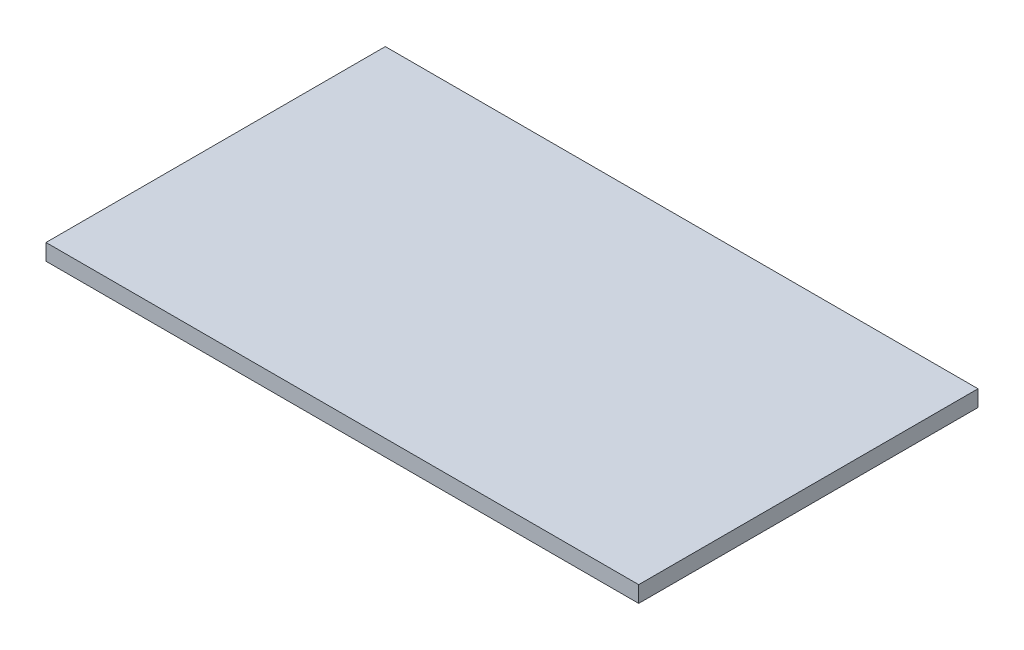
ISO-10303-21;
HEADER;
FILE_DESCRIPTION(('STEP AP214'),'2;1');
FILE_NAME('part.step','',(''),(''),'','','');
FILE_SCHEMA(('AUTOMOTIVE_DESIGN { 1 0 10303 214 1 1 1 1 }'));
ENDSEC;
DATA;
#1=APPLICATION_CONTEXT('core data for automotive mechanical design processes');
#2=APPLICATION_PROTOCOL_DEFINITION('international standard','automotive_design',2000,#1);
#3=PRODUCT_CONTEXT('',#1,'mechanical');
#4=PRODUCT('Part','Part','',(#3));
#5=PRODUCT_RELATED_PRODUCT_CATEGORY('part','',(#4));
#6=PRODUCT_DEFINITION_FORMATION('','',#4);
#7=PRODUCT_DEFINITION_CONTEXT('part definition',#1,'design');
#8=PRODUCT_DEFINITION('design','',#6,#7);
#9=PRODUCT_DEFINITION_SHAPE('','',#8);
#10=(LENGTH_UNIT() NAMED_UNIT(*) SI_UNIT(.MILLI.,.METRE.));
#11=(NAMED_UNIT(*) PLANE_ANGLE_UNIT() SI_UNIT($,.RADIAN.));
#12=(NAMED_UNIT(*) SI_UNIT($,.STERADIAN.) SOLID_ANGLE_UNIT());
#13=UNCERTAINTY_MEASURE_WITH_UNIT(LENGTH_MEASURE(1.E-05),#10,'distance_accuracy_value','');
#14=(GEOMETRIC_REPRESENTATION_CONTEXT(3) GLOBAL_UNCERTAINTY_ASSIGNED_CONTEXT((#13)) GLOBAL_UNIT_ASSIGNED_CONTEXT((#10,
#11,#12)) REPRESENTATION_CONTEXT('',''));
#15=CARTESIAN_POINT('',(0.,0.,0.));
#16=DIRECTION('',(0.,0.,1.));
#17=DIRECTION('',(1.,0.,0.));
#18=AXIS2_PLACEMENT_3D('',#15,#16,#17);
#19=CARTESIAN_POINT('',(0.,0.,0.));
#20=DIRECTION('',(0.,1.,0.));
#21=DIRECTION('',(0.,0.,1.));
#22=AXIS2_PLACEMENT_3D('',#19,#20,#21);
#23=PLANE('',#22);
#24=DIRECTION('',(-1.,0.,0.));
#25=VECTOR('',#24,1.);
#26=CARTESIAN_POINT('',(54.619,0.,-31.27));
#27=LINE('',#26,#25);
#28=CARTESIAN_POINT('',(54.619,0.,-31.27));
#29=VERTEX_POINT('',#28);
#30=CARTESIAN_POINT('',(-54.619,0.,-31.27));
#31=VERTEX_POINT('',#30);
#32=EDGE_CURVE('E198',#29,#31,#27,.T.);
#33=ORIENTED_EDGE('',*,*,#32,.F.);
#34=DIRECTION('',(0.,0.,-1.));
#35=VECTOR('',#34,1.);
#36=CARTESIAN_POINT('',(54.619,0.,31.27));
#37=LINE('',#36,#35);
#38=CARTESIAN_POINT('',(54.619,0.,31.27));
#39=VERTEX_POINT('',#38);
#40=EDGE_CURVE('E204',#39,#29,#37,.T.);
#41=ORIENTED_EDGE('',*,*,#40,.F.);
#42=DIRECTION('',(1.,0.,0.));
#43=VECTOR('',#42,1.);
#44=CARTESIAN_POINT('',(-54.619,0.,31.27));
#45=LINE('',#44,#43);
#46=CARTESIAN_POINT('',(-54.619,0.,31.27));
#47=VERTEX_POINT('',#46);
#48=EDGE_CURVE('E220',#47,#39,#45,.T.);
#49=ORIENTED_EDGE('',*,*,#48,.F.);
#50=DIRECTION('',(0.,0.,1.));
#51=VECTOR('',#50,1.);
#52=CARTESIAN_POINT('',(-54.619,0.,-31.27));
#53=LINE('',#52,#51);
#54=EDGE_CURVE('E217',#31,#47,#53,.T.);
#55=ORIENTED_EDGE('',*,*,#54,.F.);
#56=EDGE_LOOP('',(#33,#41,#49,#55));
#57=FACE_BOUND('',#56,.T.);
#58=DIRECTION('',(0.,0.,1.));
#59=VECTOR('',#58,1.);
#60=CARTESIAN_POINT('',(53.619,0.,-30.27));
#61=LINE('',#60,#59);
#62=CARTESIAN_POINT('',(53.619,0.,-30.27));
#63=VERTEX_POINT('',#62);
#64=CARTESIAN_POINT('',(53.619,0.,30.27));
#65=VERTEX_POINT('',#64);
#66=EDGE_CURVE('E129',#63,#65,#61,.T.);
#67=ORIENTED_EDGE('',*,*,#66,.F.);
#68=DIRECTION('',(1.,0.,0.));
#69=VECTOR('',#68,1.);
#70=CARTESIAN_POINT('',(-53.619,0.,-30.27));
#71=LINE('',#70,#69);
#72=CARTESIAN_POINT('',(-53.619,0.,-30.27));
#73=VERTEX_POINT('',#72);
#74=EDGE_CURVE('E161',#73,#63,#71,.T.);
#75=ORIENTED_EDGE('',*,*,#74,.F.);
#76=DIRECTION('',(0.,0.,-1.));
#77=VECTOR('',#76,1.);
#78=CARTESIAN_POINT('',(-53.619,0.,30.27));
#79=LINE('',#78,#77);
#80=CARTESIAN_POINT('',(-53.619,0.,30.27));
#81=VERTEX_POINT('',#80);
#82=EDGE_CURVE('E60',#81,#73,#79,.T.);
#83=ORIENTED_EDGE('',*,*,#82,.F.);
#84=DIRECTION('',(-1.,0.,0.));
#85=VECTOR('',#84,1.);
#86=CARTESIAN_POINT('',(53.619,0.,30.27));
#87=LINE('',#86,#85);
#88=EDGE_CURVE('E55',#65,#81,#87,.T.);
#89=ORIENTED_EDGE('',*,*,#88,.F.);
#90=EDGE_LOOP('',(#67,#75,#83,#89));
#91=FACE_BOUND('',#90,.T.);
#92=ADVANCED_FACE('F39',(#57,#91),#23,.F.);
#93=CARTESIAN_POINT('',(54.619,3.,-31.27));
#94=DIRECTION('',(0.,0.,1.));
#95=DIRECTION('',(1.,0.,0.));
#96=AXIS2_PLACEMENT_3D('',#93,#94,#95);
#97=PLANE('',#96);
#98=ORIENTED_EDGE('',*,*,#32,.T.);
#99=DIRECTION('',(0.,-1.,0.));
#100=VECTOR('',#99,1.);
#101=CARTESIAN_POINT('',(-54.619,3.,-31.27));
#102=LINE('',#101,#100);
#103=CARTESIAN_POINT('',(-54.619,3.,-31.27));
#104=VERTEX_POINT('',#103);
#105=EDGE_CURVE('E11',#104,#31,#102,.T.);
#106=ORIENTED_EDGE('',*,*,#105,.F.);
#107=DIRECTION('',(-1.,0.,0.));
#108=VECTOR('',#107,1.);
#109=CARTESIAN_POINT('',(54.619,3.,-31.27));
#110=LINE('',#109,#108);
#111=CARTESIAN_POINT('',(54.619,3.,-31.27));
#112=VERTEX_POINT('',#111);
#113=EDGE_CURVE('E199',#112,#104,#110,.T.);
#114=ORIENTED_EDGE('',*,*,#113,.F.);
#115=DIRECTION('',(0.,-1.,0.));
#116=VECTOR('',#115,1.);
#117=CARTESIAN_POINT('',(54.619,3.,-31.27));
#118=LINE('',#117,#116);
#119=EDGE_CURVE('E213',#112,#29,#118,.T.);
#120=ORIENTED_EDGE('',*,*,#119,.T.);
#121=EDGE_LOOP('',(#98,#106,#114,#120));
#122=FACE_BOUND('',#121,.T.);
#123=ADVANCED_FACE('F41',(#122),#97,.F.);
#124=CARTESIAN_POINT('',(-54.619,3.,-31.27));
#125=DIRECTION('',(1.,0.,0.));
#126=DIRECTION('',(0.,0.,-1.));
#127=AXIS2_PLACEMENT_3D('',#124,#125,#126);
#128=PLANE('',#127);
#129=ORIENTED_EDGE('',*,*,#54,.T.);
#130=DIRECTION('',(0.,-1.,0.));
#131=VECTOR('',#130,1.);
#132=CARTESIAN_POINT('',(-54.619,3.,31.27));
#133=LINE('',#132,#131);
#134=CARTESIAN_POINT('',(-54.619,3.,31.27));
#135=VERTEX_POINT('',#134);
#136=EDGE_CURVE('E48',#135,#47,#133,.T.);
#137=ORIENTED_EDGE('',*,*,#136,.F.);
#138=DIRECTION('',(0.,0.,1.));
#139=VECTOR('',#138,1.);
#140=CARTESIAN_POINT('',(-54.619,3.,-31.27));
#141=LINE('',#140,#139);
#142=EDGE_CURVE('E203',#104,#135,#141,.T.);
#143=ORIENTED_EDGE('',*,*,#142,.F.);
#144=ORIENTED_EDGE('',*,*,#105,.T.);
#145=EDGE_LOOP('',(#129,#137,#143,#144));
#146=FACE_BOUND('',#145,.T.);
#147=ADVANCED_FACE('F252',(#146),#128,.F.);
#148=CARTESIAN_POINT('',(-54.619,3.,31.27));
#149=DIRECTION('',(0.,0.,-1.));
#150=DIRECTION('',(-1.,0.,0.));
#151=AXIS2_PLACEMENT_3D('',#148,#149,#150);
#152=PLANE('',#151);
#153=ORIENTED_EDGE('',*,*,#48,.T.);
#154=DIRECTION('',(0.,-1.,0.));
#155=VECTOR('',#154,1.);
#156=CARTESIAN_POINT('',(54.619,3.,31.27));
#157=LINE('',#156,#155);
#158=CARTESIAN_POINT('',(54.619,3.,31.27));
#159=VERTEX_POINT('',#158);
#160=EDGE_CURVE('E228',#159,#39,#157,.T.);
#161=ORIENTED_EDGE('',*,*,#160,.F.);
#162=DIRECTION('',(1.,0.,0.));
#163=VECTOR('',#162,1.);
#164=CARTESIAN_POINT('',(-54.619,3.,31.27));
#165=LINE('',#164,#163);
#166=EDGE_CURVE('E207',#135,#159,#165,.T.);
#167=ORIENTED_EDGE('',*,*,#166,.F.);
#168=ORIENTED_EDGE('',*,*,#136,.T.);
#169=EDGE_LOOP('',(#153,#161,#167,#168));
#170=FACE_BOUND('',#169,.T.);
#171=ADVANCED_FACE('F237',(#170),#152,.F.);
#172=CARTESIAN_POINT('',(54.619,3.,31.27));
#173=DIRECTION('',(-1.,0.,0.));
#174=DIRECTION('',(0.,0.,1.));
#175=AXIS2_PLACEMENT_3D('',#172,#173,#174);
#176=PLANE('',#175);
#177=ORIENTED_EDGE('',*,*,#40,.T.);
#178=ORIENTED_EDGE('',*,*,#119,.F.);
#179=DIRECTION('',(0.,0.,-1.));
#180=VECTOR('',#179,1.);
#181=CARTESIAN_POINT('',(54.619,3.,31.27));
#182=LINE('',#181,#180);
#183=EDGE_CURVE('E210',#159,#112,#182,.T.);
#184=ORIENTED_EDGE('',*,*,#183,.F.);
#185=ORIENTED_EDGE('',*,*,#160,.T.);
#186=EDGE_LOOP('',(#177,#178,#184,#185));
#187=FACE_BOUND('',#186,.T.);
#188=ADVANCED_FACE('F245',(#187),#176,.F.);
#189=CARTESIAN_POINT('',(0.,3.,0.));
#190=DIRECTION('',(0.,1.,0.));
#191=DIRECTION('',(0.,0.,1.));
#192=AXIS2_PLACEMENT_3D('',#189,#190,#191);
#193=PLANE('',#192);
#194=ORIENTED_EDGE('',*,*,#113,.T.);
#195=ORIENTED_EDGE('',*,*,#142,.T.);
#196=ORIENTED_EDGE('',*,*,#166,.T.);
#197=ORIENTED_EDGE('',*,*,#183,.T.);
#198=EDGE_LOOP('',(#194,#195,#196,#197));
#199=FACE_BOUND('',#198,.T.);
#200=ADVANCED_FACE('F251',(#199),#193,.T.);
#201=CARTESIAN_POINT('',(53.619,0.,-30.27));
#202=DIRECTION('',(0.707106781186546,-0.707106781186549,0.));
#203=DIRECTION('',(0.707106781186549,0.707106781186546,0.));
#204=AXIS2_PLACEMENT_3D('',#201,#202,#203);
#205=PLANE('',#204);
#206=DIRECTION('',(0.,0.,-1.));
#207=VECTOR('',#206,1.);
#208=CARTESIAN_POINT('',(53.119,-0.499999999999999,-30.27));
#209=LINE('',#208,#207);
#210=CARTESIAN_POINT('',(53.119,-0.499999999999999,-29.77));
#211=VERTEX_POINT('',#210);
#212=CARTESIAN_POINT('',(53.119,-0.499999999999999,29.77));
#213=VERTEX_POINT('',#212);
#214=EDGE_CURVE('E124',#211,#213,#209,.F.);
#215=ORIENTED_EDGE('',*,*,#214,.F.);
#216=DIRECTION('',(0.577350269189627,0.577350269189624,-0.577350269189627));
#217=VECTOR('',#216,1.);
#218=CARTESIAN_POINT('',(53.619,0.,-30.27));
#219=LINE('',#218,#217);
#220=EDGE_CURVE('E165',#211,#63,#219,.T.);
#221=ORIENTED_EDGE('',*,*,#220,.T.);
#222=ORIENTED_EDGE('',*,*,#66,.T.);
#223=DIRECTION('',(0.577350269189627,0.577350269189624,0.577350269189627));
#224=VECTOR('',#223,1.);
#225=CARTESIAN_POINT('',(53.619,0.,30.27));
#226=LINE('',#225,#224);
#227=EDGE_CURVE('E166',#213,#65,#226,.T.);
#228=ORIENTED_EDGE('',*,*,#227,.F.);
#229=EDGE_LOOP('',(#215,#221,#222,#228));
#230=FACE_BOUND('',#229,.T.);
#231=ADVANCED_FACE('F281',(#230),#205,.T.);
#232=CARTESIAN_POINT('',(53.619,0.,30.27));
#233=DIRECTION('',(0.,-0.707106781186549,0.707106781186546));
#234=DIRECTION('',(0.,-0.707106781186546,-0.707106781186549));
#235=AXIS2_PLACEMENT_3D('',#232,#233,#234);
#236=PLANE('',#235);
#237=DIRECTION('',(1.,0.,0.));
#238=VECTOR('',#237,1.);
#239=CARTESIAN_POINT('',(53.619,-0.499999999999999,29.77));
#240=LINE('',#239,#238);
#241=CARTESIAN_POINT('',(-53.119,-0.499999999999999,29.77));
#242=VERTEX_POINT('',#241);
#243=EDGE_CURVE('E188',#213,#242,#240,.F.);
#244=ORIENTED_EDGE('',*,*,#243,.F.);
#245=ORIENTED_EDGE('',*,*,#227,.T.);
#246=ORIENTED_EDGE('',*,*,#88,.T.);
#247=DIRECTION('',(-0.577350269189627,0.577350269189624,0.577350269189627));
#248=VECTOR('',#247,1.);
#249=CARTESIAN_POINT('',(-53.619,0.,30.27));
#250=LINE('',#249,#248);
#251=EDGE_CURVE('E169',#242,#81,#250,.T.);
#252=ORIENTED_EDGE('',*,*,#251,.F.);
#253=EDGE_LOOP('',(#244,#245,#246,#252));
#254=FACE_BOUND('',#253,.T.);
#255=ADVANCED_FACE('F286',(#254),#236,.T.);
#256=CARTESIAN_POINT('',(-53.619,0.,30.27));
#257=DIRECTION('',(-0.707106781186546,-0.707106781186549,0.));
#258=DIRECTION('',(0.707106781186549,-0.707106781186546,0.));
#259=AXIS2_PLACEMENT_3D('',#256,#257,#258);
#260=PLANE('',#259);
#261=DIRECTION('',(0.,0.,1.));
#262=VECTOR('',#261,1.);
#263=CARTESIAN_POINT('',(-53.119,-0.499999999999999,30.27));
#264=LINE('',#263,#262);
#265=CARTESIAN_POINT('',(-53.119,-0.499999999999999,-29.77));
#266=VERTEX_POINT('',#265);
#267=EDGE_CURVE('E191',#242,#266,#264,.F.);
#268=ORIENTED_EDGE('',*,*,#267,.F.);
#269=ORIENTED_EDGE('',*,*,#251,.T.);
#270=ORIENTED_EDGE('',*,*,#82,.T.);
#271=DIRECTION('',(-0.577350269189627,0.577350269189624,-0.577350269189627));
#272=VECTOR('',#271,1.);
#273=CARTESIAN_POINT('',(-53.619,0.,-30.27));
#274=LINE('',#273,#272);
#275=EDGE_CURVE('E173',#266,#73,#274,.T.);
#276=ORIENTED_EDGE('',*,*,#275,.F.);
#277=EDGE_LOOP('',(#268,#269,#270,#276));
#278=FACE_BOUND('',#277,.T.);
#279=ADVANCED_FACE('F334',(#278),#260,.T.);
#280=CARTESIAN_POINT('',(-53.619,0.,-30.27));
#281=DIRECTION('',(0.,-0.707106781186549,-0.707106781186546));
#282=DIRECTION('',(0.,0.707106781186546,-0.707106781186549));
#283=AXIS2_PLACEMENT_3D('',#280,#281,#282);
#284=PLANE('',#283);
#285=DIRECTION('',(-1.,0.,0.));
#286=VECTOR('',#285,1.);
#287=CARTESIAN_POINT('',(-53.619,-0.499999999999999,-29.77));
#288=LINE('',#287,#286);
#289=EDGE_CURVE('E195',#266,#211,#288,.F.);
#290=ORIENTED_EDGE('',*,*,#289,.F.);
#291=ORIENTED_EDGE('',*,*,#275,.T.);
#292=ORIENTED_EDGE('',*,*,#74,.T.);
#293=ORIENTED_EDGE('',*,*,#220,.F.);
#294=EDGE_LOOP('',(#290,#291,#292,#293));
#295=FACE_BOUND('',#294,.T.);
#296=ADVANCED_FACE('F343',(#295),#284,.T.);
#297=CARTESIAN_POINT('',(52.619,0.,-29.27));
#298=DIRECTION('',(-0.707106781186546,-0.707106781186549,0.));
#299=DIRECTION('',(0.707106781186549,-0.707106781186546,0.));
#300=AXIS2_PLACEMENT_3D('',#297,#298,#299);
#301=PLANE('',#300);
#302=DIRECTION('',(-0.577350269189627,0.577350269189624,0.577350269189627));
#303=VECTOR('',#302,1.);
#304=CARTESIAN_POINT('',(52.619,0.,-29.27));
#305=LINE('',#304,#303);
#306=CARTESIAN_POINT('',(52.619,0.,-29.27));
#307=VERTEX_POINT('',#306);
#308=EDGE_CURVE('E153',#211,#307,#305,.T.);
#309=ORIENTED_EDGE('',*,*,#308,.F.);
#310=ORIENTED_EDGE('',*,*,#214,.T.);
#311=DIRECTION('',(-0.577350269189627,0.577350269189624,-0.577350269189627));
#312=VECTOR('',#311,1.);
#313=CARTESIAN_POINT('',(52.619,0.,29.27));
#314=LINE('',#313,#312);
#315=CARTESIAN_POINT('',(52.619,0.,29.27));
#316=VERTEX_POINT('',#315);
#317=EDGE_CURVE('E116',#213,#316,#314,.T.);
#318=ORIENTED_EDGE('',*,*,#317,.T.);
#319=DIRECTION('',(0.,0.,1.));
#320=VECTOR('',#319,1.);
#321=CARTESIAN_POINT('',(52.619,0.,-29.27));
#322=LINE('',#321,#320);
#323=EDGE_CURVE('E121',#307,#316,#322,.T.);
#324=ORIENTED_EDGE('',*,*,#323,.F.);
#325=EDGE_LOOP('',(#309,#310,#318,#324));
#326=FACE_BOUND('',#325,.T.);
#327=ADVANCED_FACE('F119',(#326),#301,.T.);
#328=CARTESIAN_POINT('',(52.619,0.,29.27));
#329=DIRECTION('',(0.,-0.707106781186549,-0.707106781186546));
#330=DIRECTION('',(0.,0.707106781186546,-0.707106781186549));
#331=AXIS2_PLACEMENT_3D('',#328,#329,#330);
#332=PLANE('',#331);
#333=ORIENTED_EDGE('',*,*,#317,.F.);
#334=ORIENTED_EDGE('',*,*,#243,.T.);
#335=DIRECTION('',(0.577350269189627,0.577350269189624,-0.577350269189627));
#336=VECTOR('',#335,1.);
#337=CARTESIAN_POINT('',(-52.619,0.,29.27));
#338=LINE('',#337,#336);
#339=CARTESIAN_POINT('',(-52.619,0.,29.27));
#340=VERTEX_POINT('',#339);
#341=EDGE_CURVE('E130',#242,#340,#338,.T.);
#342=ORIENTED_EDGE('',*,*,#341,.T.);
#343=DIRECTION('',(-1.,0.,0.));
#344=VECTOR('',#343,1.);
#345=CARTESIAN_POINT('',(52.619,0.,29.27));
#346=LINE('',#345,#344);
#347=EDGE_CURVE('E133',#316,#340,#346,.T.);
#348=ORIENTED_EDGE('',*,*,#347,.F.);
#349=EDGE_LOOP('',(#333,#334,#342,#348));
#350=FACE_BOUND('',#349,.T.);
#351=ADVANCED_FACE('F134',(#350),#332,.T.);
#352=CARTESIAN_POINT('',(-52.619,0.,29.27));
#353=DIRECTION('',(0.707106781186546,-0.707106781186549,0.));
#354=DIRECTION('',(0.707106781186549,0.707106781186546,0.));
#355=AXIS2_PLACEMENT_3D('',#352,#353,#354);
#356=PLANE('',#355);
#357=ORIENTED_EDGE('',*,*,#341,.F.);
#358=ORIENTED_EDGE('',*,*,#267,.T.);
#359=DIRECTION('',(0.577350269189627,0.577350269189624,0.577350269189627));
#360=VECTOR('',#359,1.);
#361=CARTESIAN_POINT('',(-52.619,0.,-29.27));
#362=LINE('',#361,#360);
#363=CARTESIAN_POINT('',(-52.619,0.,-29.27));
#364=VERTEX_POINT('',#363);
#365=EDGE_CURVE('E180',#266,#364,#362,.T.);
#366=ORIENTED_EDGE('',*,*,#365,.T.);
#367=DIRECTION('',(0.,0.,-1.));
#368=VECTOR('',#367,1.);
#369=CARTESIAN_POINT('',(-52.619,0.,29.27));
#370=LINE('',#369,#368);
#371=EDGE_CURVE('E140',#340,#364,#370,.T.);
#372=ORIENTED_EDGE('',*,*,#371,.F.);
#373=EDGE_LOOP('',(#357,#358,#366,#372));
#374=FACE_BOUND('',#373,.T.);
#375=ADVANCED_FACE('F270',(#374),#356,.T.);
#376=CARTESIAN_POINT('',(-52.619,0.,-29.27));
#377=DIRECTION('',(0.,-0.707106781186549,0.707106781186546));
#378=DIRECTION('',(0.,-0.707106781186546,-0.707106781186549));
#379=AXIS2_PLACEMENT_3D('',#376,#377,#378);
#380=PLANE('',#379);
#381=ORIENTED_EDGE('',*,*,#365,.F.);
#382=ORIENTED_EDGE('',*,*,#289,.T.);
#383=ORIENTED_EDGE('',*,*,#308,.T.);
#384=DIRECTION('',(1.,0.,0.));
#385=VECTOR('',#384,1.);
#386=CARTESIAN_POINT('',(-52.619,0.,-29.27));
#387=LINE('',#386,#385);
#388=EDGE_CURVE('E145',#364,#307,#387,.T.);
#389=ORIENTED_EDGE('',*,*,#388,.F.);
#390=EDGE_LOOP('',(#381,#382,#383,#389));
#391=FACE_BOUND('',#390,.T.);
#392=ADVANCED_FACE('F266',(#391),#380,.T.);
#393=ORIENTED_EDGE('',*,*,#388,.T.);
#394=ORIENTED_EDGE('',*,*,#323,.T.);
#395=ORIENTED_EDGE('',*,*,#347,.T.);
#396=ORIENTED_EDGE('',*,*,#371,.T.);
#397=EDGE_LOOP('',(#393,#394,#395,#396));
#398=FACE_BOUND('',#397,.T.);
#399=ADVANCED_FACE('F143',(#398),#23,.F.);
#400=CLOSED_SHELL('',(#92,#123,#147,#171,#188,#200,#231,#255,#279,#296,#327,#351,#375,#392,#399));
#401=MANIFOLD_SOLID_BREP('B2',#400);
#402=ADVANCED_BREP_SHAPE_REPRESENTATION('',(#18,#401),#14);
#403=SHAPE_DEFINITION_REPRESENTATION(#9,#402);
ENDSEC;
END-ISO-10303-21;
